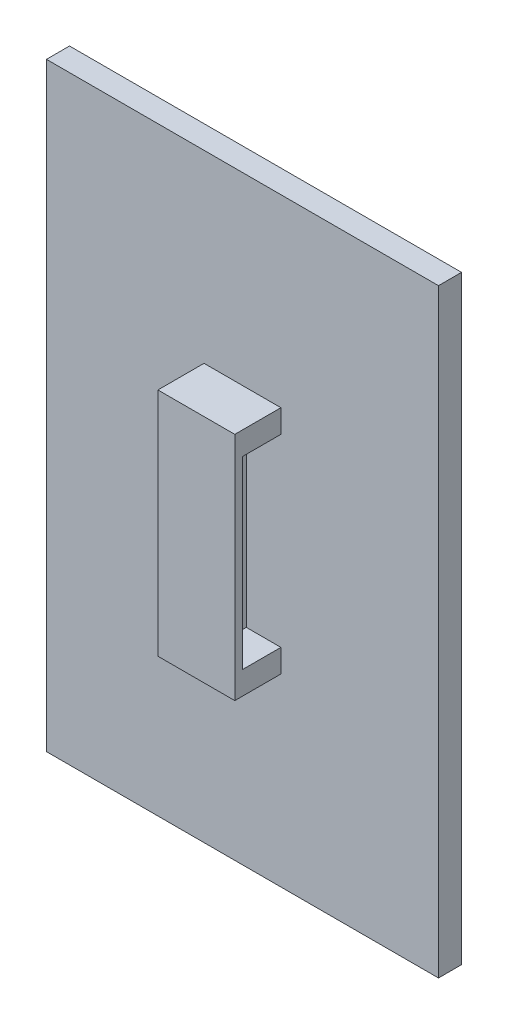
ISO-10303-21;
HEADER;
FILE_DESCRIPTION(('STEP AP214'),'2;1');
FILE_NAME('part.step','',(''),(''),'','','');
FILE_SCHEMA(('AUTOMOTIVE_DESIGN { 1 0 10303 214 1 1 1 1 }'));
ENDSEC;
DATA;
#1=APPLICATION_CONTEXT('core data for automotive mechanical design processes');
#2=APPLICATION_PROTOCOL_DEFINITION('international standard','automotive_design',2000,#1);
#3=PRODUCT_CONTEXT('',#1,'mechanical');
#4=PRODUCT('Part','Part','',(#3));
#5=PRODUCT_RELATED_PRODUCT_CATEGORY('part','',(#4));
#6=PRODUCT_DEFINITION_FORMATION('','',#4);
#7=PRODUCT_DEFINITION_CONTEXT('part definition',#1,'design');
#8=PRODUCT_DEFINITION('design','',#6,#7);
#9=PRODUCT_DEFINITION_SHAPE('','',#8);
#10=(LENGTH_UNIT() NAMED_UNIT(*) SI_UNIT(.MILLI.,.METRE.));
#11=(NAMED_UNIT(*) PLANE_ANGLE_UNIT() SI_UNIT($,.RADIAN.));
#12=(NAMED_UNIT(*) SI_UNIT($,.STERADIAN.) SOLID_ANGLE_UNIT());
#13=UNCERTAINTY_MEASURE_WITH_UNIT(LENGTH_MEASURE(1.E-05),#10,'distance_accuracy_value','');
#14=(GEOMETRIC_REPRESENTATION_CONTEXT(3) GLOBAL_UNCERTAINTY_ASSIGNED_CONTEXT((#13)) GLOBAL_UNIT_ASSIGNED_CONTEXT((#10,
#11,#12)) REPRESENTATION_CONTEXT('',''));
#15=CARTESIAN_POINT('',(0.,0.,0.));
#16=DIRECTION('',(0.,0.,1.));
#17=DIRECTION('',(1.,0.,0.));
#18=AXIS2_PLACEMENT_3D('',#15,#16,#17);
#19=CARTESIAN_POINT('',(0.,0.,3.));
#20=DIRECTION('',(0.,0.,1.));
#21=DIRECTION('',(1.,0.,0.));
#22=AXIS2_PLACEMENT_3D('',#19,#20,#21);
#23=PLANE('',#22);
#24=DIRECTION('',(0.,1.,0.));
#25=VECTOR('',#24,1.);
#26=CARTESIAN_POINT('',(0.,0.,3.));
#27=LINE('',#26,#25);
#28=CARTESIAN_POINT('',(0.,0.,3.));
#29=VERTEX_POINT('',#28);
#30=CARTESIAN_POINT('',(0.,78.,3.));
#31=VERTEX_POINT('',#30);
#32=EDGE_CURVE('E230',#29,#31,#27,.T.);
#33=ORIENTED_EDGE('',*,*,#32,.T.);
#34=DIRECTION('',(-1.,0.,0.));
#35=VECTOR('',#34,1.);
#36=CARTESIAN_POINT('',(0.,78.,3.));
#37=LINE('',#36,#35);
#38=CARTESIAN_POINT('',(-51.,78.,3.));
#39=VERTEX_POINT('',#38);
#40=EDGE_CURVE('E232',#31,#39,#37,.T.);
#41=ORIENTED_EDGE('',*,*,#40,.T.);
#42=DIRECTION('',(0.,-1.,0.));
#43=VECTOR('',#42,1.);
#44=CARTESIAN_POINT('',(-51.,0.,3.));
#45=LINE('',#44,#43);
#46=CARTESIAN_POINT('',(-51.,0.,3.));
#47=VERTEX_POINT('',#46);
#48=EDGE_CURVE('E235',#39,#47,#45,.T.);
#49=ORIENTED_EDGE('',*,*,#48,.T.);
#50=DIRECTION('',(1.,0.,0.));
#51=VECTOR('',#50,1.);
#52=CARTESIAN_POINT('',(0.,0.,3.));
#53=LINE('',#52,#51);
#54=EDGE_CURVE('E237',#47,#29,#53,.T.);
#55=ORIENTED_EDGE('',*,*,#54,.T.);
#56=EDGE_LOOP('',(#33,#41,#49,#55));
#57=FACE_BOUND('',#56,.T.);
#58=DIRECTION('',(-1.,0.,0.));
#59=VECTOR('',#58,1.);
#60=CARTESIAN_POINT('',(0.,27.,3.));
#61=LINE('',#60,#59);
#62=CARTESIAN_POINT('',(-26.,27.,3.));
#63=VERTEX_POINT('',#62);
#64=CARTESIAN_POINT('',(-30.5,27.,3.));
#65=VERTEX_POINT('',#64);
#66=EDGE_CURVE('E161',#63,#65,#61,.T.);
#67=ORIENTED_EDGE('',*,*,#66,.F.);
#68=DIRECTION('',(0.,1.,0.));
#69=VECTOR('',#68,1.);
#70=CARTESIAN_POINT('',(-26.,-0.002000000000002,3.));
#71=LINE('',#70,#69);
#72=CARTESIAN_POINT('',(-26.,51.,3.));
#73=VERTEX_POINT('',#72);
#74=EDGE_CURVE('E172',#63,#73,#71,.T.);
#75=ORIENTED_EDGE('',*,*,#74,.T.);
#76=DIRECTION('',(-1.,0.,0.));
#77=VECTOR('',#76,1.);
#78=CARTESIAN_POINT('',(0.,51.,3.));
#79=LINE('',#78,#77);
#80=CARTESIAN_POINT('',(-30.5,51.,3.));
#81=VERTEX_POINT('',#80);
#82=EDGE_CURVE('E160',#73,#81,#79,.T.);
#83=ORIENTED_EDGE('',*,*,#82,.T.);
#84=DIRECTION('',(0.,-1.,0.));
#85=VECTOR('',#84,1.);
#86=CARTESIAN_POINT('',(-30.5,54.,3.));
#87=LINE('',#86,#85);
#88=CARTESIAN_POINT('',(-30.5,54.,3.));
#89=VERTEX_POINT('',#88);
#90=EDGE_CURVE('E213',#89,#81,#87,.T.);
#91=ORIENTED_EDGE('',*,*,#90,.F.);
#92=DIRECTION('',(-1.,0.,0.));
#93=VECTOR('',#92,1.);
#94=CARTESIAN_POINT('',(-20.5,54.,3.));
#95=LINE('',#94,#93);
#96=CARTESIAN_POINT('',(-20.5,54.,3.));
#97=VERTEX_POINT('',#96);
#98=EDGE_CURVE('E209',#97,#89,#95,.T.);
#99=ORIENTED_EDGE('',*,*,#98,.F.);
#100=DIRECTION('',(0.,1.,0.));
#101=VECTOR('',#100,1.);
#102=CARTESIAN_POINT('',(-20.5,54.,3.));
#103=LINE('',#102,#101);
#104=CARTESIAN_POINT('',(-20.5,51.,3.));
#105=VERTEX_POINT('',#104);
#106=EDGE_CURVE('E196',#105,#97,#103,.T.);
#107=ORIENTED_EDGE('',*,*,#106,.F.);
#108=CARTESIAN_POINT('',(-25.,51.,3.));
#109=VERTEX_POINT('',#108);
#110=EDGE_CURVE('E169',#105,#109,#79,.T.);
#111=ORIENTED_EDGE('',*,*,#110,.T.);
#112=DIRECTION('',(0.,1.,0.));
#113=VECTOR('',#112,1.);
#114=CARTESIAN_POINT('',(-25.,-0.002000000000002,3.));
#115=LINE('',#114,#113);
#116=CARTESIAN_POINT('',(-25.,27.,3.));
#117=VERTEX_POINT('',#116);
#118=EDGE_CURVE('E165',#117,#109,#115,.T.);
#119=ORIENTED_EDGE('',*,*,#118,.F.);
#120=CARTESIAN_POINT('',(-20.5,27.,3.));
#121=VERTEX_POINT('',#120);
#122=EDGE_CURVE('E150',#121,#117,#61,.T.);
#123=ORIENTED_EDGE('',*,*,#122,.F.);
#124=CARTESIAN_POINT('',(-20.5,24.,3.));
#125=VERTEX_POINT('',#124);
#126=EDGE_CURVE('E207',#125,#121,#103,.T.);
#127=ORIENTED_EDGE('',*,*,#126,.F.);
#128=DIRECTION('',(1.,0.,0.));
#129=VECTOR('',#128,1.);
#130=CARTESIAN_POINT('',(-20.5,24.,3.));
#131=LINE('',#130,#129);
#132=CARTESIAN_POINT('',(-30.5,24.,3.));
#133=VERTEX_POINT('',#132);
#134=EDGE_CURVE('E200',#133,#125,#131,.T.);
#135=ORIENTED_EDGE('',*,*,#134,.F.);
#136=EDGE_CURVE('E212',#65,#133,#87,.T.);
#137=ORIENTED_EDGE('',*,*,#136,.F.);
#138=EDGE_LOOP('',(#67,#75,#83,#91,#99,#107,#111,#119,#123,#127,#135,#137));
#139=FACE_BOUND('',#138,.T.);
#140=ADVANCED_FACE('F37',(#57,#139),#23,.T.);
#141=CARTESIAN_POINT('',(0.,51.,3.));
#142=DIRECTION('',(0.,1.,0.));
#143=DIRECTION('',(-1.,0.,0.));
#144=AXIS2_PLACEMENT_3D('',#141,#142,#143);
#145=PLANE('',#144);
#146=DIRECTION('',(0.,0.,-1.));
#147=VECTOR('',#146,1.);
#148=CARTESIAN_POINT('',(-26.,51.,4.));
#149=LINE('',#148,#147);
#150=CARTESIAN_POINT('',(-26.,51.,4.));
#151=VERTEX_POINT('',#150);
#152=EDGE_CURVE('E52',#151,#73,#149,.T.);
#153=ORIENTED_EDGE('',*,*,#152,.F.);
#154=DIRECTION('',(0.74740931868366,0.,-0.664363838829919));
#155=VECTOR('',#154,1.);
#156=CARTESIAN_POINT('',(-26.,51.,4.));
#157=LINE('',#156,#155);
#158=CARTESIAN_POINT('',(-30.5,51.,8.));
#159=VERTEX_POINT('',#158);
#160=EDGE_CURVE('E469',#159,#151,#157,.T.);
#161=ORIENTED_EDGE('',*,*,#160,.F.);
#162=DIRECTION('',(0.,0.,-1.));
#163=VECTOR('',#162,1.);
#164=CARTESIAN_POINT('',(-30.5,51.,3.));
#165=LINE('',#164,#163);
#166=EDGE_CURVE('E189',#159,#81,#165,.T.);
#167=ORIENTED_EDGE('',*,*,#166,.T.);
#168=ORIENTED_EDGE('',*,*,#82,.F.);
#169=EDGE_LOOP('',(#153,#161,#167,#168));
#170=FACE_BOUND('',#169,.T.);
#171=ADVANCED_FACE('F280',(#170),#145,.F.);
#172=DIRECTION('',(0.74740931868366,0.,0.664363838829919));
#173=VECTOR('',#172,1.);
#174=CARTESIAN_POINT('',(-20.5,51.,8.));
#175=LINE('',#174,#173);
#176=CARTESIAN_POINT('',(-25.,51.,4.));
#177=VERTEX_POINT('',#176);
#178=CARTESIAN_POINT('',(-20.5,51.,8.));
#179=VERTEX_POINT('',#178);
#180=EDGE_CURVE('E60',#177,#179,#175,.T.);
#181=ORIENTED_EDGE('',*,*,#180,.F.);
#182=DIRECTION('',(0.,0.,1.));
#183=VECTOR('',#182,1.);
#184=CARTESIAN_POINT('',(-25.,51.,3.));
#185=LINE('',#184,#183);
#186=EDGE_CURVE('E473',#109,#177,#185,.T.);
#187=ORIENTED_EDGE('',*,*,#186,.F.);
#188=ORIENTED_EDGE('',*,*,#110,.F.);
#189=DIRECTION('',(0.,0.,-1.));
#190=VECTOR('',#189,1.);
#191=CARTESIAN_POINT('',(-20.5,51.,9.));
#192=LINE('',#191,#190);
#193=EDGE_CURVE('E194',#179,#105,#192,.T.);
#194=ORIENTED_EDGE('',*,*,#193,.F.);
#195=EDGE_LOOP('',(#181,#187,#188,#194));
#196=FACE_BOUND('',#195,.T.);
#197=ADVANCED_FACE('F286',(#196),#145,.F.);
#198=CARTESIAN_POINT('',(0.,27.,3.));
#199=DIRECTION('',(0.,-1.,0.));
#200=DIRECTION('',(1.,0.,0.));
#201=AXIS2_PLACEMENT_3D('',#198,#199,#200);
#202=PLANE('',#201);
#203=DIRECTION('',(0.,0.,-1.));
#204=VECTOR('',#203,1.);
#205=CARTESIAN_POINT('',(-26.,27.,4.));
#206=LINE('',#205,#204);
#207=CARTESIAN_POINT('',(-26.,27.,3.99999999999999));
#208=VERTEX_POINT('',#207);
#209=EDGE_CURVE('E178',#208,#63,#206,.T.);
#210=ORIENTED_EDGE('',*,*,#209,.T.);
#211=ORIENTED_EDGE('',*,*,#66,.T.);
#212=DIRECTION('',(0.,0.,1.));
#213=VECTOR('',#212,1.);
#214=CARTESIAN_POINT('',(-30.5,27.,3.));
#215=LINE('',#214,#213);
#216=CARTESIAN_POINT('',(-30.5,27.,8.));
#217=VERTEX_POINT('',#216);
#218=EDGE_CURVE('E180',#65,#217,#215,.T.);
#219=ORIENTED_EDGE('',*,*,#218,.T.);
#220=DIRECTION('',(0.74740931868366,0.,-0.664363838829919));
#221=VECTOR('',#220,1.);
#222=CARTESIAN_POINT('',(-26.,27.,4.));
#223=LINE('',#222,#221);
#224=EDGE_CURVE('E182',#217,#208,#223,.T.);
#225=ORIENTED_EDGE('',*,*,#224,.T.);
#226=EDGE_LOOP('',(#210,#211,#219,#225));
#227=FACE_BOUND('',#226,.T.);
#228=ADVANCED_FACE('F327',(#227),#202,.F.);
#229=DIRECTION('',(0.74740931868366,0.,0.664363838829919));
#230=VECTOR('',#229,1.);
#231=CARTESIAN_POINT('',(-20.5,27.,8.));
#232=LINE('',#231,#230);
#233=CARTESIAN_POINT('',(-25.,27.,4.));
#234=VERTEX_POINT('',#233);
#235=CARTESIAN_POINT('',(-20.5,27.,8.));
#236=VERTEX_POINT('',#235);
#237=EDGE_CURVE('E177',#234,#236,#232,.T.);
#238=ORIENTED_EDGE('',*,*,#237,.T.);
#239=DIRECTION('',(0.,0.,1.));
#240=VECTOR('',#239,1.);
#241=CARTESIAN_POINT('',(-20.5,27.,9.));
#242=LINE('',#241,#240);
#243=EDGE_CURVE('E157',#121,#236,#242,.T.);
#244=ORIENTED_EDGE('',*,*,#243,.F.);
#245=ORIENTED_EDGE('',*,*,#122,.T.);
#246=DIRECTION('',(0.,0.,1.));
#247=VECTOR('',#246,1.);
#248=CARTESIAN_POINT('',(-25.,27.,3.));
#249=LINE('',#248,#247);
#250=EDGE_CURVE('E154',#117,#234,#249,.T.);
#251=ORIENTED_EDGE('',*,*,#250,.T.);
#252=EDGE_LOOP('',(#238,#244,#245,#251));
#253=FACE_BOUND('',#252,.T.);
#254=ADVANCED_FACE('F152',(#253),#202,.F.);
#255=CARTESIAN_POINT('',(0.,0.,3.));
#256=DIRECTION('',(-1.,0.,0.));
#257=DIRECTION('',(0.,-1.,0.));
#258=AXIS2_PLACEMENT_3D('',#255,#256,#257);
#259=PLANE('',#258);
#260=DIRECTION('',(0.,1.,0.));
#261=VECTOR('',#260,1.);
#262=CARTESIAN_POINT('',(0.,0.,0.));
#263=LINE('',#262,#261);
#264=CARTESIAN_POINT('',(0.,0.,0.));
#265=VERTEX_POINT('',#264);
#266=CARTESIAN_POINT('',(0.,78.,0.));
#267=VERTEX_POINT('',#266);
#268=EDGE_CURVE('E229',#265,#267,#263,.T.);
#269=ORIENTED_EDGE('',*,*,#268,.T.);
#270=DIRECTION('',(0.,0.,-1.));
#271=VECTOR('',#270,1.);
#272=CARTESIAN_POINT('',(0.,78.,3.));
#273=LINE('',#272,#271);
#274=EDGE_CURVE('E11',#31,#267,#273,.T.);
#275=ORIENTED_EDGE('',*,*,#274,.F.);
#276=ORIENTED_EDGE('',*,*,#32,.F.);
#277=DIRECTION('',(0.,0.,-1.));
#278=VECTOR('',#277,1.);
#279=CARTESIAN_POINT('',(0.,0.,3.));
#280=LINE('',#279,#278);
#281=EDGE_CURVE('E239',#29,#265,#280,.T.);
#282=ORIENTED_EDGE('',*,*,#281,.T.);
#283=EDGE_LOOP('',(#269,#275,#276,#282));
#284=FACE_BOUND('',#283,.T.);
#285=ADVANCED_FACE('F39',(#284),#259,.F.);
#286=CARTESIAN_POINT('',(0.,78.,3.));
#287=DIRECTION('',(0.,-1.,0.));
#288=DIRECTION('',(1.,0.,0.));
#289=AXIS2_PLACEMENT_3D('',#286,#287,#288);
#290=PLANE('',#289);
#291=DIRECTION('',(-1.,0.,0.));
#292=VECTOR('',#291,1.);
#293=CARTESIAN_POINT('',(0.,78.,0.));
#294=LINE('',#293,#292);
#295=CARTESIAN_POINT('',(-51.,78.,0.));
#296=VERTEX_POINT('',#295);
#297=EDGE_CURVE('E242',#267,#296,#294,.T.);
#298=ORIENTED_EDGE('',*,*,#297,.T.);
#299=DIRECTION('',(0.,0.,-1.));
#300=VECTOR('',#299,1.);
#301=CARTESIAN_POINT('',(-51.,78.,3.));
#302=LINE('',#301,#300);
#303=EDGE_CURVE('E45',#39,#296,#302,.T.);
#304=ORIENTED_EDGE('',*,*,#303,.F.);
#305=ORIENTED_EDGE('',*,*,#40,.F.);
#306=ORIENTED_EDGE('',*,*,#274,.T.);
#307=EDGE_LOOP('',(#298,#304,#305,#306));
#308=FACE_BOUND('',#307,.T.);
#309=ADVANCED_FACE('F272',(#308),#290,.F.);
#310=CARTESIAN_POINT('',(-51.,0.,3.));
#311=DIRECTION('',(1.,0.,0.));
#312=DIRECTION('',(0.,0.,-1.));
#313=AXIS2_PLACEMENT_3D('',#310,#311,#312);
#314=PLANE('',#313);
#315=DIRECTION('',(0.,-1.,0.));
#316=VECTOR('',#315,1.);
#317=CARTESIAN_POINT('',(-51.,0.,0.));
#318=LINE('',#317,#316);
#319=CARTESIAN_POINT('',(-51.,0.,0.));
#320=VERTEX_POINT('',#319);
#321=EDGE_CURVE('E244',#296,#320,#318,.T.);
#322=ORIENTED_EDGE('',*,*,#321,.T.);
#323=DIRECTION('',(0.,0.,-1.));
#324=VECTOR('',#323,1.);
#325=CARTESIAN_POINT('',(-51.,0.,3.));
#326=LINE('',#325,#324);
#327=EDGE_CURVE('E249',#47,#320,#326,.T.);
#328=ORIENTED_EDGE('',*,*,#327,.F.);
#329=ORIENTED_EDGE('',*,*,#48,.F.);
#330=ORIENTED_EDGE('',*,*,#303,.T.);
#331=EDGE_LOOP('',(#322,#328,#329,#330));
#332=FACE_BOUND('',#331,.T.);
#333=ADVANCED_FACE('F256',(#332),#314,.F.);
#334=CARTESIAN_POINT('',(0.,0.,3.));
#335=DIRECTION('',(0.,1.,0.));
#336=DIRECTION('',(0.,0.,1.));
#337=AXIS2_PLACEMENT_3D('',#334,#335,#336);
#338=PLANE('',#337);
#339=DIRECTION('',(1.,0.,0.));
#340=VECTOR('',#339,1.);
#341=CARTESIAN_POINT('',(0.,0.,0.));
#342=LINE('',#341,#340);
#343=EDGE_CURVE('E233',#320,#265,#342,.T.);
#344=ORIENTED_EDGE('',*,*,#343,.T.);
#345=ORIENTED_EDGE('',*,*,#281,.F.);
#346=ORIENTED_EDGE('',*,*,#54,.F.);
#347=ORIENTED_EDGE('',*,*,#327,.T.);
#348=EDGE_LOOP('',(#344,#345,#346,#347));
#349=FACE_BOUND('',#348,.T.);
#350=ADVANCED_FACE('F266',(#349),#338,.F.);
#351=CARTESIAN_POINT('',(0.,0.,0.));
#352=DIRECTION('',(0.,0.,1.));
#353=DIRECTION('',(1.,0.,0.));
#354=AXIS2_PLACEMENT_3D('',#351,#352,#353);
#355=PLANE('',#354);
#356=ORIENTED_EDGE('',*,*,#268,.F.);
#357=ORIENTED_EDGE('',*,*,#343,.F.);
#358=ORIENTED_EDGE('',*,*,#321,.F.);
#359=ORIENTED_EDGE('',*,*,#297,.F.);
#360=EDGE_LOOP('',(#356,#357,#358,#359));
#361=FACE_BOUND('',#360,.T.);
#362=ADVANCED_FACE('F263',(#361),#355,.F.);
#363=CARTESIAN_POINT('',(-20.5,54.,9.));
#364=DIRECTION('',(-1.,0.,0.));
#365=DIRECTION('',(0.,-1.,0.));
#366=AXIS2_PLACEMENT_3D('',#363,#364,#365);
#367=PLANE('',#366);
#368=ORIENTED_EDGE('',*,*,#126,.T.);
#369=ORIENTED_EDGE('',*,*,#243,.T.);
#370=DIRECTION('',(0.,1.,0.));
#371=VECTOR('',#370,1.);
#372=CARTESIAN_POINT('',(-20.5,-0.002000000000002,8.));
#373=LINE('',#372,#371);
#374=EDGE_CURVE('E451',#236,#179,#373,.T.);
#375=ORIENTED_EDGE('',*,*,#374,.T.);
#376=ORIENTED_EDGE('',*,*,#193,.T.);
#377=ORIENTED_EDGE('',*,*,#106,.T.);
#378=DIRECTION('',(0.,0.,-1.));
#379=VECTOR('',#378,1.);
#380=CARTESIAN_POINT('',(-20.5,54.,9.));
#381=LINE('',#380,#379);
#382=CARTESIAN_POINT('',(-20.5,54.,9.));
#383=VERTEX_POINT('',#382);
#384=EDGE_CURVE('E226',#383,#97,#381,.T.);
#385=ORIENTED_EDGE('',*,*,#384,.F.);
#386=DIRECTION('',(0.,1.,0.));
#387=VECTOR('',#386,1.);
#388=CARTESIAN_POINT('',(-20.5,54.,9.));
#389=LINE('',#388,#387);
#390=CARTESIAN_POINT('',(-20.5,24.,9.));
#391=VERTEX_POINT('',#390);
#392=EDGE_CURVE('E197',#391,#383,#389,.T.);
#393=ORIENTED_EDGE('',*,*,#392,.F.);
#394=DIRECTION('',(0.,0.,-1.));
#395=VECTOR('',#394,1.);
#396=CARTESIAN_POINT('',(-20.5,24.,9.));
#397=LINE('',#396,#395);
#398=EDGE_CURVE('E206',#391,#125,#397,.T.);
#399=ORIENTED_EDGE('',*,*,#398,.T.);
#400=EDGE_LOOP('',(#368,#369,#375,#376,#377,#385,#393,#399));
#401=FACE_BOUND('',#400,.T.);
#402=ADVANCED_FACE('F290',(#401),#367,.F.);
#403=CARTESIAN_POINT('',(-20.5,54.,9.));
#404=DIRECTION('',(0.,-1.,0.));
#405=DIRECTION('',(0.,0.,-1.));
#406=AXIS2_PLACEMENT_3D('',#403,#404,#405);
#407=PLANE('',#406);
#408=ORIENTED_EDGE('',*,*,#98,.T.);
#409=DIRECTION('',(0.,0.,-1.));
#410=VECTOR('',#409,1.);
#411=CARTESIAN_POINT('',(-30.5,54.,9.));
#412=LINE('',#411,#410);
#413=CARTESIAN_POINT('',(-30.5,54.,9.));
#414=VERTEX_POINT('',#413);
#415=EDGE_CURVE('E223',#414,#89,#412,.T.);
#416=ORIENTED_EDGE('',*,*,#415,.F.);
#417=DIRECTION('',(-1.,0.,0.));
#418=VECTOR('',#417,1.);
#419=CARTESIAN_POINT('',(-20.5,54.,9.));
#420=LINE('',#419,#418);
#421=EDGE_CURVE('E199',#383,#414,#420,.T.);
#422=ORIENTED_EDGE('',*,*,#421,.F.);
#423=ORIENTED_EDGE('',*,*,#384,.T.);
#424=EDGE_LOOP('',(#408,#416,#422,#423));
#425=FACE_BOUND('',#424,.T.);
#426=ADVANCED_FACE('F307',(#425),#407,.F.);
#427=CARTESIAN_POINT('',(-30.5,54.,9.));
#428=DIRECTION('',(1.,0.,0.));
#429=DIRECTION('',(0.,1.,0.));
#430=AXIS2_PLACEMENT_3D('',#427,#428,#429);
#431=PLANE('',#430);
#432=DIRECTION('',(0.,0.,-1.));
#433=VECTOR('',#432,1.);
#434=CARTESIAN_POINT('',(-30.5,24.,9.));
#435=LINE('',#434,#433);
#436=CARTESIAN_POINT('',(-30.5,24.,9.));
#437=VERTEX_POINT('',#436);
#438=EDGE_CURVE('E220',#437,#133,#435,.T.);
#439=ORIENTED_EDGE('',*,*,#438,.F.);
#440=DIRECTION('',(0.,-1.,0.));
#441=VECTOR('',#440,1.);
#442=CARTESIAN_POINT('',(-30.5,54.,9.));
#443=LINE('',#442,#441);
#444=EDGE_CURVE('E202',#414,#437,#443,.T.);
#445=ORIENTED_EDGE('',*,*,#444,.F.);
#446=ORIENTED_EDGE('',*,*,#415,.T.);
#447=ORIENTED_EDGE('',*,*,#90,.T.);
#448=ORIENTED_EDGE('',*,*,#166,.F.);
#449=DIRECTION('',(0.,1.,0.));
#450=VECTOR('',#449,1.);
#451=CARTESIAN_POINT('',(-30.5,-0.00199999999999506,8.));
#452=LINE('',#451,#450);
#453=EDGE_CURVE('E187',#217,#159,#452,.T.);
#454=ORIENTED_EDGE('',*,*,#453,.F.);
#455=ORIENTED_EDGE('',*,*,#218,.F.);
#456=ORIENTED_EDGE('',*,*,#136,.T.);
#457=EDGE_LOOP('',(#439,#445,#446,#447,#448,#454,#455,#456));
#458=FACE_BOUND('',#457,.T.);
#459=ADVANCED_FACE('F310',(#458),#431,.F.);
#460=CARTESIAN_POINT('',(-20.5,24.,9.));
#461=DIRECTION('',(0.,1.,0.));
#462=DIRECTION('',(0.,0.,1.));
#463=AXIS2_PLACEMENT_3D('',#460,#461,#462);
#464=PLANE('',#463);
#465=ORIENTED_EDGE('',*,*,#134,.T.);
#466=ORIENTED_EDGE('',*,*,#398,.F.);
#467=DIRECTION('',(1.,0.,0.));
#468=VECTOR('',#467,1.);
#469=CARTESIAN_POINT('',(-20.5,24.,9.));
#470=LINE('',#469,#468);
#471=EDGE_CURVE('E204',#437,#391,#470,.T.);
#472=ORIENTED_EDGE('',*,*,#471,.F.);
#473=ORIENTED_EDGE('',*,*,#438,.T.);
#474=EDGE_LOOP('',(#465,#466,#472,#473));
#475=FACE_BOUND('',#474,.T.);
#476=ADVANCED_FACE('F315',(#475),#464,.F.);
#477=CARTESIAN_POINT('',(0.,0.,9.));
#478=DIRECTION('',(0.,0.,-1.));
#479=DIRECTION('',(-1.,0.,0.));
#480=AXIS2_PLACEMENT_3D('',#477,#478,#479);
#481=PLANE('',#480);
#482=ORIENTED_EDGE('',*,*,#392,.T.);
#483=ORIENTED_EDGE('',*,*,#421,.T.);
#484=ORIENTED_EDGE('',*,*,#444,.T.);
#485=ORIENTED_EDGE('',*,*,#471,.T.);
#486=EDGE_LOOP('',(#482,#483,#484,#485));
#487=FACE_BOUND('',#486,.T.);
#488=ADVANCED_FACE('F318',(#487),#481,.F.);
#489=CARTESIAN_POINT('',(-26.,-0.002000000000002,4.));
#490=DIRECTION('',(1.,0.,0.));
#491=DIRECTION('',(0.,1.,0.));
#492=AXIS2_PLACEMENT_3D('',#489,#490,#491);
#493=PLANE('',#492);
#494=ORIENTED_EDGE('',*,*,#209,.F.);
#495=DIRECTION('',(0.,1.,0.));
#496=VECTOR('',#495,1.);
#497=CARTESIAN_POINT('',(-26.,-0.002000000000002,4.));
#498=LINE('',#497,#496);
#499=EDGE_CURVE('E464',#208,#151,#498,.T.);
#500=ORIENTED_EDGE('',*,*,#499,.T.);
#501=ORIENTED_EDGE('',*,*,#152,.T.);
#502=ORIENTED_EDGE('',*,*,#74,.F.);
#503=EDGE_LOOP('',(#494,#500,#501,#502));
#504=FACE_BOUND('',#503,.T.);
#505=ADVANCED_FACE('F371',(#504),#493,.F.);
#506=CARTESIAN_POINT('',(-26.,-0.002000000000002,4.));
#507=DIRECTION('',(0.664363838829919,0.,0.74740931868366));
#508=DIRECTION('',(0.74740931868366,0.,-0.664363838829919));
#509=AXIS2_PLACEMENT_3D('',#506,#507,#508);
#510=PLANE('',#509);
#511=ORIENTED_EDGE('',*,*,#224,.F.);
#512=ORIENTED_EDGE('',*,*,#453,.T.);
#513=ORIENTED_EDGE('',*,*,#160,.T.);
#514=ORIENTED_EDGE('',*,*,#499,.F.);
#515=EDGE_LOOP('',(#511,#512,#513,#514));
#516=FACE_BOUND('',#515,.T.);
#517=ADVANCED_FACE('F379',(#516),#510,.F.);
#518=CARTESIAN_POINT('',(-20.5,-0.002000000000002,8.));
#519=DIRECTION('',(-0.664363838829919,0.,0.74740931868366));
#520=DIRECTION('',(0.74740931868366,0.,0.664363838829919));
#521=AXIS2_PLACEMENT_3D('',#518,#519,#520);
#522=PLANE('',#521);
#523=ORIENTED_EDGE('',*,*,#237,.F.);
#524=DIRECTION('',(0.,1.,0.));
#525=VECTOR('',#524,1.);
#526=CARTESIAN_POINT('',(-25.,-0.002000000000002,4.));
#527=LINE('',#526,#525);
#528=EDGE_CURVE('E173',#234,#177,#527,.T.);
#529=ORIENTED_EDGE('',*,*,#528,.T.);
#530=ORIENTED_EDGE('',*,*,#180,.T.);
#531=ORIENTED_EDGE('',*,*,#374,.F.);
#532=EDGE_LOOP('',(#523,#529,#530,#531));
#533=FACE_BOUND('',#532,.T.);
#534=ADVANCED_FACE('F387',(#533),#522,.F.);
#535=CARTESIAN_POINT('',(-25.,-0.002000000000002,3.));
#536=DIRECTION('',(-1.,0.,0.));
#537=DIRECTION('',(0.,-1.,0.));
#538=AXIS2_PLACEMENT_3D('',#535,#536,#537);
#539=PLANE('',#538);
#540=ORIENTED_EDGE('',*,*,#250,.F.);
#541=ORIENTED_EDGE('',*,*,#118,.T.);
#542=ORIENTED_EDGE('',*,*,#186,.T.);
#543=ORIENTED_EDGE('',*,*,#528,.F.);
#544=EDGE_LOOP('',(#540,#541,#542,#543));
#545=FACE_BOUND('',#544,.T.);
#546=ADVANCED_FACE('F176',(#545),#539,.F.);
#547=CLOSED_SHELL('',(#140,#171,#197,#228,#254,#285,#309,#333,#350,#362,#402,#426,#459,#476,
#488,#505,#517,#534,#546));
#548=MANIFOLD_SOLID_BREP('B2',#547);
#549=ADVANCED_BREP_SHAPE_REPRESENTATION('',(#18,#548),#14);
#550=SHAPE_DEFINITION_REPRESENTATION(#9,#549);
ENDSEC;
END-ISO-10303-21;
